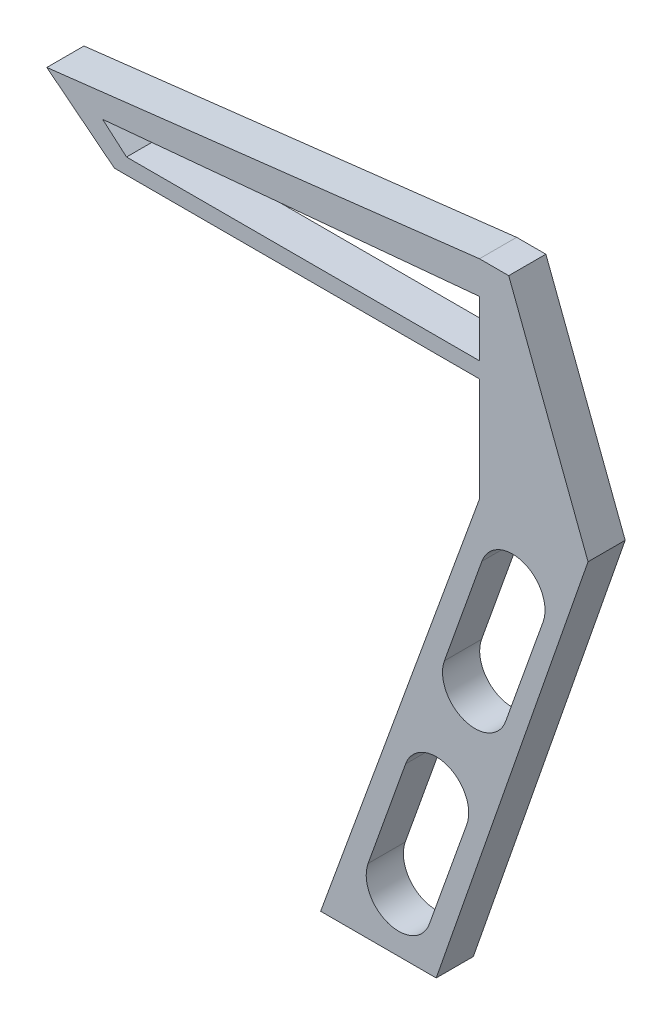
ISO-10303-21;
HEADER;
FILE_DESCRIPTION(('STEP AP214'),'2;1');
FILE_NAME('part.step','',(''),(''),'','','');
FILE_SCHEMA(('AUTOMOTIVE_DESIGN { 1 0 10303 214 1 1 1 1 }'));
ENDSEC;
DATA;
#1=APPLICATION_CONTEXT('core data for automotive mechanical design processes');
#2=APPLICATION_PROTOCOL_DEFINITION('international standard','automotive_design',2000,#1);
#3=PRODUCT_CONTEXT('',#1,'mechanical');
#4=PRODUCT('Part','Part','',(#3));
#5=PRODUCT_RELATED_PRODUCT_CATEGORY('part','',(#4));
#6=PRODUCT_DEFINITION_FORMATION('','',#4);
#7=PRODUCT_DEFINITION_CONTEXT('part definition',#1,'design');
#8=PRODUCT_DEFINITION('design','',#6,#7);
#9=PRODUCT_DEFINITION_SHAPE('','',#8);
#10=(LENGTH_UNIT() NAMED_UNIT(*) SI_UNIT(.MILLI.,.METRE.));
#11=(NAMED_UNIT(*) PLANE_ANGLE_UNIT() SI_UNIT($,.RADIAN.));
#12=(NAMED_UNIT(*) SI_UNIT($,.STERADIAN.) SOLID_ANGLE_UNIT());
#13=UNCERTAINTY_MEASURE_WITH_UNIT(LENGTH_MEASURE(1.E-05),#10,'distance_accuracy_value','');
#14=(GEOMETRIC_REPRESENTATION_CONTEXT(3) GLOBAL_UNCERTAINTY_ASSIGNED_CONTEXT((#13)) GLOBAL_UNIT_ASSIGNED_CONTEXT((#10,
#11,#12)) REPRESENTATION_CONTEXT('',''));
#15=CARTESIAN_POINT('',(0.,0.,0.));
#16=DIRECTION('',(0.,0.,1.));
#17=DIRECTION('',(1.,0.,0.));
#18=AXIS2_PLACEMENT_3D('',#15,#16,#17);
#19=CARTESIAN_POINT('',(0.,0.,20.));
#20=DIRECTION('',(-1.,0.,0.));
#21=DIRECTION('',(0.,0.,1.));
#22=AXIS2_PLACEMENT_3D('',#19,#20,#21);
#23=PLANE('',#22);
#24=DIRECTION('',(0.,1.,0.));
#25=VECTOR('',#24,1.);
#26=CARTESIAN_POINT('',(0.,0.,0.));
#27=LINE('',#26,#25);
#28=CARTESIAN_POINT('',(0.,0.,0.));
#29=VERTEX_POINT('',#28);
#30=CARTESIAN_POINT('',(0.,30.,0.));
#31=VERTEX_POINT('',#30);
#32=EDGE_CURVE('E256',#29,#31,#27,.T.);
#33=ORIENTED_EDGE('',*,*,#32,.F.);
#34=DIRECTION('',(0.,0.,-1.));
#35=VECTOR('',#34,1.);
#36=CARTESIAN_POINT('',(0.,0.,20.));
#37=LINE('',#36,#35);
#38=CARTESIAN_POINT('',(0.,0.,20.));
#39=VERTEX_POINT('',#38);
#40=EDGE_CURVE('E11',#39,#29,#37,.T.);
#41=ORIENTED_EDGE('',*,*,#40,.F.);
#42=DIRECTION('',(0.,1.,0.));
#43=VECTOR('',#42,1.);
#44=CARTESIAN_POINT('',(0.,0.,20.));
#45=LINE('',#44,#43);
#46=CARTESIAN_POINT('',(0.,30.,20.));
#47=VERTEX_POINT('',#46);
#48=EDGE_CURVE('E202',#39,#47,#45,.T.);
#49=ORIENTED_EDGE('',*,*,#48,.T.);
#50=DIRECTION('',(0.,0.,-1.));
#51=VECTOR('',#50,1.);
#52=CARTESIAN_POINT('',(0.,30.,20.));
#53=LINE('',#52,#51);
#54=EDGE_CURVE('E55',#47,#31,#53,.T.);
#55=ORIENTED_EDGE('',*,*,#54,.T.);
#56=EDGE_LOOP('',(#33,#41,#49,#55));
#57=FACE_BOUND('',#56,.T.);
#58=ADVANCED_FACE('F36',(#57),#23,.T.);
#59=CARTESIAN_POINT('',(0.,0.,20.));
#60=DIRECTION('',(0.,1.,0.));
#61=DIRECTION('',(0.,0.,1.));
#62=AXIS2_PLACEMENT_3D('',#59,#60,#61);
#63=PLANE('',#62);
#64=DIRECTION('',(1.,0.,0.));
#65=VECTOR('',#64,1.);
#66=CARTESIAN_POINT('',(0.,0.,0.));
#67=LINE('',#66,#65);
#68=CARTESIAN_POINT('',(-190.,0.,0.));
#69=VERTEX_POINT('',#68);
#70=EDGE_CURVE('E191',#69,#29,#67,.T.);
#71=ORIENTED_EDGE('',*,*,#70,.F.);
#72=DIRECTION('',(0.,0.,-1.));
#73=VECTOR('',#72,1.);
#74=CARTESIAN_POINT('',(-190.,0.,20.));
#75=LINE('',#74,#73);
#76=CARTESIAN_POINT('',(-190.,0.,20.));
#77=VERTEX_POINT('',#76);
#78=EDGE_CURVE('E46',#77,#69,#75,.T.);
#79=ORIENTED_EDGE('',*,*,#78,.F.);
#80=DIRECTION('',(1.,0.,0.));
#81=VECTOR('',#80,1.);
#82=CARTESIAN_POINT('',(0.,0.,20.));
#83=LINE('',#82,#81);
#84=EDGE_CURVE('E189',#77,#39,#83,.T.);
#85=ORIENTED_EDGE('',*,*,#84,.T.);
#86=ORIENTED_EDGE('',*,*,#40,.T.);
#87=EDGE_LOOP('',(#71,#79,#85,#86));
#88=FACE_BOUND('',#87,.T.);
#89=ADVANCED_FACE('F188',(#88),#63,.T.);
#90=CARTESIAN_POINT('',(-81.4268809778505,-94.0253712569675,20.));
#91=DIRECTION('',(0.654646875393422,0.755934830880036,0.));
#92=DIRECTION('',(-0.755934830880036,0.654646875393422,0.));
#93=AXIS2_PLACEMENT_3D('',#90,#91,#92);
#94=PLANE('',#93);
#95=DIRECTION('',(0.755934830880036,-0.654646875393422,0.));
#96=VECTOR('',#95,1.);
#97=CARTESIAN_POINT('',(-81.4268809778505,-94.0253712569675,0.));
#98=LINE('',#97,#96);
#99=CARTESIAN_POINT('',(-202.860967669863,11.1377224010301,0.));
#100=VERTEX_POINT('',#99);
#101=EDGE_CURVE('E259',#100,#69,#98,.T.);
#102=ORIENTED_EDGE('',*,*,#101,.F.);
#103=DIRECTION('',(0.,0.,-1.));
#104=VECTOR('',#103,1.);
#105=CARTESIAN_POINT('',(-202.860967669863,11.1377224010301,20.));
#106=LINE('',#105,#104);
#107=CARTESIAN_POINT('',(-202.860967669863,11.1377224010301,20.));
#108=VERTEX_POINT('',#107);
#109=EDGE_CURVE('E119',#108,#100,#106,.T.);
#110=ORIENTED_EDGE('',*,*,#109,.F.);
#111=DIRECTION('',(0.755934830880036,-0.654646875393422,0.));
#112=VECTOR('',#111,1.);
#113=CARTESIAN_POINT('',(-81.4268809778505,-94.0253712569675,20.));
#114=LINE('',#113,#112);
#115=EDGE_CURVE('E201',#108,#77,#114,.T.);
#116=ORIENTED_EDGE('',*,*,#115,.T.);
#117=ORIENTED_EDGE('',*,*,#78,.T.);
#118=EDGE_LOOP('',(#102,#110,#116,#117));
#119=FACE_BOUND('',#118,.T.);
#120=ADVANCED_FACE('F204',(#119),#94,.T.);
#121=CARTESIAN_POINT('',(-2.39478141390136,-155.187164151721,20.));
#122=DIRECTION('',(0.,0.,-1.));
#123=DIRECTION('',(-1.,0.,0.));
#124=AXIS2_PLACEMENT_3D('',#121,#122,#123);
#125=CYLINDRICAL_SURFACE('',#124,17.5);
#126=CARTESIAN_POINT('',(-2.39478141390136,-155.187164151721,0.));
#127=DIRECTION('',(0.,0.,1.));
#128=DIRECTION('',(1.,0.,0.));
#129=AXIS2_PLACEMENT_3D('',#126,#127,#128);
#130=CIRCLE('',#129,17.5);
#131=CARTESIAN_POINT('',(-18.8752790768257,-149.301316992446,0.));
#132=VERTEX_POINT('',#131);
#133=CARTESIAN_POINT('',(14.0857162490229,-161.073011310997,0.));
#134=VERTEX_POINT('',#133);
#135=EDGE_CURVE('E244',#132,#134,#130,.T.);
#136=ORIENTED_EDGE('',*,*,#135,.F.);
#137=DIRECTION('',(0.,0.,-1.));
#138=VECTOR('',#137,1.);
#139=CARTESIAN_POINT('',(-18.8752790768257,-149.301316992446,20.));
#140=LINE('',#139,#138);
#141=CARTESIAN_POINT('',(-18.8752790768257,-149.301316992446,20.));
#142=VERTEX_POINT('',#141);
#143=EDGE_CURVE('E266',#142,#132,#140,.T.);
#144=ORIENTED_EDGE('',*,*,#143,.F.);
#145=CARTESIAN_POINT('',(-2.39478141390136,-155.187164151721,20.));
#146=DIRECTION('',(0.,0.,1.));
#147=DIRECTION('',(1.,0.,0.));
#148=AXIS2_PLACEMENT_3D('',#145,#146,#147);
#149=CIRCLE('',#148,17.5);
#150=CARTESIAN_POINT('',(14.0857162490229,-161.073011310997,20.));
#151=VERTEX_POINT('',#150);
#152=EDGE_CURVE('E354',#142,#151,#149,.T.);
#153=ORIENTED_EDGE('',*,*,#152,.T.);
#154=DIRECTION('',(0.,0.,-1.));
#155=VECTOR('',#154,1.);
#156=CARTESIAN_POINT('',(14.0857162490229,-161.073011310997,20.));
#157=LINE('',#156,#155);
#158=EDGE_CURVE('E268',#151,#134,#157,.T.);
#159=ORIENTED_EDGE('',*,*,#158,.T.);
#160=EDGE_LOOP('',(#136,#144,#153,#159));
#161=FACE_BOUND('',#160,.T.);
#162=ADVANCED_FACE('F398',(#161),#125,.F.);
#163=CARTESIAN_POINT('',(30.5496356253496,-10.9105009897164,20.));
#164=DIRECTION('',(0.941742723595674,-0.336334123387149,0.));
#165=DIRECTION('',(0.336334123387149,0.941742723595674,0.));
#166=AXIS2_PLACEMENT_3D('',#163,#164,#165);
#167=PLANE('',#166);
#168=DIRECTION('',(-0.336334123387149,-0.941742723595674,0.));
#169=VECTOR('',#168,1.);
#170=CARTESIAN_POINT('',(30.5496356253496,-10.9105009897164,0.));
#171=LINE('',#170,#169);
#172=CARTESIAN_POINT('',(1.30476832640328,-92.796753576706,0.));
#173=VERTEX_POINT('',#172);
#174=EDGE_CURVE('E247',#173,#132,#171,.T.);
#175=ORIENTED_EDGE('',*,*,#174,.F.);
#176=DIRECTION('',(0.,0.,-1.));
#177=VECTOR('',#176,1.);
#178=CARTESIAN_POINT('',(1.30476832640328,-92.796753576706,20.));
#179=LINE('',#178,#177);
#180=CARTESIAN_POINT('',(1.30476832640328,-92.796753576706,20.));
#181=VERTEX_POINT('',#180);
#182=EDGE_CURVE('E273',#181,#173,#179,.T.);
#183=ORIENTED_EDGE('',*,*,#182,.F.);
#184=DIRECTION('',(-0.336334123387149,-0.941742723595674,0.));
#185=VECTOR('',#184,1.);
#186=CARTESIAN_POINT('',(30.5496356253496,-10.9105009897164,20.));
#187=LINE('',#186,#185);
#188=EDGE_CURVE('E357',#181,#142,#187,.T.);
#189=ORIENTED_EDGE('',*,*,#188,.T.);
#190=ORIENTED_EDGE('',*,*,#143,.T.);
#191=EDGE_LOOP('',(#175,#183,#189,#190));
#192=FACE_BOUND('',#191,.T.);
#193=ADVANCED_FACE('F394',(#192),#167,.T.);
#194=CARTESIAN_POINT('',(17.7852659893276,-98.6826007359811,20.));
#195=DIRECTION('',(0.,0.,-1.));
#196=DIRECTION('',(-1.,0.,0.));
#197=AXIS2_PLACEMENT_3D('',#194,#195,#196);
#198=CYLINDRICAL_SURFACE('',#197,17.5);
#199=CARTESIAN_POINT('',(17.7852659893276,-98.6826007359811,0.));
#200=DIRECTION('',(0.,0.,1.));
#201=DIRECTION('',(1.,0.,0.));
#202=AXIS2_PLACEMENT_3D('',#199,#200,#201);
#203=CIRCLE('',#202,17.5);
#204=CARTESIAN_POINT('',(34.2657636522519,-104.568447895256,0.));
#205=VERTEX_POINT('',#204);
#206=EDGE_CURVE('E250',#205,#173,#203,.T.);
#207=ORIENTED_EDGE('',*,*,#206,.F.);
#208=DIRECTION('',(0.,0.,-1.));
#209=VECTOR('',#208,1.);
#210=CARTESIAN_POINT('',(34.2657636522519,-104.568447895256,20.));
#211=LINE('',#210,#209);
#212=CARTESIAN_POINT('',(34.2657636522519,-104.568447895256,20.));
#213=VERTEX_POINT('',#212);
#214=EDGE_CURVE('E270',#213,#205,#211,.T.);
#215=ORIENTED_EDGE('',*,*,#214,.F.);
#216=CARTESIAN_POINT('',(17.7852659893276,-98.6826007359811,20.));
#217=DIRECTION('',(0.,0.,1.));
#218=DIRECTION('',(1.,0.,0.));
#219=AXIS2_PLACEMENT_3D('',#216,#217,#218);
#220=CIRCLE('',#219,17.5);
#221=EDGE_CURVE('E360',#213,#181,#220,.T.);
#222=ORIENTED_EDGE('',*,*,#221,.T.);
#223=ORIENTED_EDGE('',*,*,#182,.T.);
#224=EDGE_LOOP('',(#207,#215,#222,#223));
#225=FACE_BOUND('',#224,.T.);
#226=ADVANCED_FACE('F390',(#225),#198,.F.);
#227=CARTESIAN_POINT('',(-43.4763949847619,-270.216558922331,20.));
#228=DIRECTION('',(0.,0.,-1.));
#229=DIRECTION('',(-1.,0.,0.));
#230=AXIS2_PLACEMENT_3D('',#227,#228,#229);
#231=CYLINDRICAL_SURFACE('',#230,17.5);
#232=CARTESIAN_POINT('',(-43.4763949847619,-270.216558922331,0.));
#233=DIRECTION('',(0.,0.,1.));
#234=DIRECTION('',(1.,0.,0.));
#235=AXIS2_PLACEMENT_3D('',#232,#233,#234);
#236=CIRCLE('',#235,17.5);
#237=CARTESIAN_POINT('',(-59.9568926476862,-264.330711763056,0.));
#238=VERTEX_POINT('',#237);
#239=CARTESIAN_POINT('',(-26.9958973218376,-276.102406081606,0.));
#240=VERTEX_POINT('',#239);
#241=EDGE_CURVE('E232',#238,#240,#236,.T.);
#242=ORIENTED_EDGE('',*,*,#241,.F.);
#243=DIRECTION('',(0.,0.,-1.));
#244=VECTOR('',#243,1.);
#245=CARTESIAN_POINT('',(-59.9568926476862,-264.330711763056,20.));
#246=LINE('',#245,#244);
#247=CARTESIAN_POINT('',(-59.9568926476862,-264.330711763056,20.));
#248=VERTEX_POINT('',#247);
#249=EDGE_CURVE('E271',#248,#238,#246,.T.);
#250=ORIENTED_EDGE('',*,*,#249,.F.);
#251=CARTESIAN_POINT('',(-43.4763949847619,-270.216558922331,20.));
#252=DIRECTION('',(0.,0.,1.));
#253=DIRECTION('',(1.,0.,0.));
#254=AXIS2_PLACEMENT_3D('',#251,#252,#253);
#255=CIRCLE('',#254,17.5);
#256=CARTESIAN_POINT('',(-26.9958973218376,-276.102406081606,20.));
#257=VERTEX_POINT('',#256);
#258=EDGE_CURVE('E343',#248,#257,#255,.T.);
#259=ORIENTED_EDGE('',*,*,#258,.T.);
#260=DIRECTION('',(0.,0.,-1.));
#261=VECTOR('',#260,1.);
#262=CARTESIAN_POINT('',(-26.9958973218376,-276.102406081606,20.));
#263=LINE('',#262,#261);
#264=EDGE_CURVE('E276',#257,#240,#263,.T.);
#265=ORIENTED_EDGE('',*,*,#264,.T.);
#266=EDGE_LOOP('',(#242,#250,#259,#265));
#267=FACE_BOUND('',#266,.T.);
#268=ADVANCED_FACE('F393',(#267),#231,.F.);
#269=CARTESIAN_POINT('',(30.5496356253497,-10.9105009897164,20.));
#270=DIRECTION('',(0.941742723595674,-0.336334123387149,0.));
#271=DIRECTION('',(0.336334123387149,0.941742723595674,0.));
#272=AXIS2_PLACEMENT_3D('',#269,#270,#271);
#273=PLANE('',#272);
#274=DIRECTION('',(-0.336334123387149,-0.941742723595674,0.));
#275=VECTOR('',#274,1.);
#276=CARTESIAN_POINT('',(30.5496356253497,-10.9105009897164,0.));
#277=LINE('',#276,#275);
#278=CARTESIAN_POINT('',(-39.7768452444572,-207.826148347315,0.));
#279=VERTEX_POINT('',#278);
#280=EDGE_CURVE('E235',#279,#238,#277,.T.);
#281=ORIENTED_EDGE('',*,*,#280,.F.);
#282=DIRECTION('',(0.,0.,-1.));
#283=VECTOR('',#282,1.);
#284=CARTESIAN_POINT('',(-39.7768452444572,-207.826148347315,20.));
#285=LINE('',#284,#283);
#286=CARTESIAN_POINT('',(-39.7768452444572,-207.826148347315,20.));
#287=VERTEX_POINT('',#286);
#288=EDGE_CURVE('E280',#287,#279,#285,.T.);
#289=ORIENTED_EDGE('',*,*,#288,.F.);
#290=DIRECTION('',(-0.336334123387149,-0.941742723595674,0.));
#291=VECTOR('',#290,1.);
#292=CARTESIAN_POINT('',(30.5496356253497,-10.9105009897164,20.));
#293=LINE('',#292,#291);
#294=EDGE_CURVE('E346',#287,#248,#293,.T.);
#295=ORIENTED_EDGE('',*,*,#294,.T.);
#296=ORIENTED_EDGE('',*,*,#249,.T.);
#297=EDGE_LOOP('',(#281,#289,#295,#296));
#298=FACE_BOUND('',#297,.T.);
#299=ADVANCED_FACE('F409',(#298),#273,.T.);
#300=CARTESIAN_POINT('',(-23.2963475815329,-213.71199550659,20.));
#301=DIRECTION('',(0.,0.,-1.));
#302=DIRECTION('',(-1.,0.,0.));
#303=AXIS2_PLACEMENT_3D('',#300,#301,#302);
#304=CYLINDRICAL_SURFACE('',#303,17.5);
#305=CARTESIAN_POINT('',(-23.2963475815329,-213.71199550659,0.));
#306=DIRECTION('',(0.,0.,1.));
#307=DIRECTION('',(1.,0.,0.));
#308=AXIS2_PLACEMENT_3D('',#305,#306,#307);
#309=CIRCLE('',#308,17.5);
#310=CARTESIAN_POINT('',(-6.81584991860862,-219.597842665865,0.));
#311=VERTEX_POINT('',#310);
#312=EDGE_CURVE('E238',#311,#279,#309,.T.);
#313=ORIENTED_EDGE('',*,*,#312,.F.);
#314=DIRECTION('',(0.,0.,-1.));
#315=VECTOR('',#314,1.);
#316=CARTESIAN_POINT('',(-6.81584991860862,-219.597842665865,20.));
#317=LINE('',#316,#315);
#318=CARTESIAN_POINT('',(-6.81584991860862,-219.597842665865,20.));
#319=VERTEX_POINT('',#318);
#320=EDGE_CURVE('E278',#319,#311,#317,.T.);
#321=ORIENTED_EDGE('',*,*,#320,.F.);
#322=CARTESIAN_POINT('',(-23.2963475815329,-213.71199550659,20.));
#323=DIRECTION('',(0.,0.,1.));
#324=DIRECTION('',(1.,0.,0.));
#325=AXIS2_PLACEMENT_3D('',#322,#323,#324);
#326=CIRCLE('',#325,17.5);
#327=EDGE_CURVE('E349',#319,#287,#326,.T.);
#328=ORIENTED_EDGE('',*,*,#327,.T.);
#329=ORIENTED_EDGE('',*,*,#288,.T.);
#330=EDGE_LOOP('',(#313,#321,#328,#329));
#331=FACE_BOUND('',#330,.T.);
#332=ADVANCED_FACE('F406',(#331),#304,.F.);
#333=CARTESIAN_POINT('',(0.,-8.45740838362147,20.));
#334=DIRECTION('',(0.,1.,0.));
#335=DIRECTION('',(0.,0.,1.));
#336=AXIS2_PLACEMENT_3D('',#333,#334,#335);
#337=PLANE('',#336);
#338=DIRECTION('',(1.,0.,0.));
#339=VECTOR('',#338,1.);
#340=CARTESIAN_POINT('',(0.,-8.45740838362147,0.));
#341=LINE('',#340,#339);
#342=CARTESIAN_POINT('',(-196.533735711257,-8.45740838362144,0.));
#343=VERTEX_POINT('',#342);
#344=CARTESIAN_POINT('',(0.,-8.45740838362147,0.));
#345=VERTEX_POINT('',#344);
#346=EDGE_CURVE('E211',#343,#345,#341,.T.);
#347=ORIENTED_EDGE('',*,*,#346,.T.);
#348=DIRECTION('',(0.,0.,-1.));
#349=VECTOR('',#348,1.);
#350=CARTESIAN_POINT('',(0.,-8.45740838362147,20.));
#351=LINE('',#350,#349);
#352=CARTESIAN_POINT('',(0.,-8.45740838362147,20.));
#353=VERTEX_POINT('',#352);
#354=EDGE_CURVE('E40',#353,#345,#351,.T.);
#355=ORIENTED_EDGE('',*,*,#354,.F.);
#356=DIRECTION('',(1.,0.,0.));
#357=VECTOR('',#356,1.);
#358=CARTESIAN_POINT('',(0.,-8.45740838362147,20.));
#359=LINE('',#358,#357);
#360=CARTESIAN_POINT('',(-196.533735711257,-8.45740838362144,20.));
#361=VERTEX_POINT('',#360);
#362=EDGE_CURVE('E264',#361,#353,#359,.T.);
#363=ORIENTED_EDGE('',*,*,#362,.F.);
#364=DIRECTION('',(0.,0.,-1.));
#365=VECTOR('',#364,1.);
#366=CARTESIAN_POINT('',(-196.533735711257,-8.45740838362144,20.));
#367=LINE('',#366,#365);
#368=EDGE_CURVE('E207',#361,#343,#367,.T.);
#369=ORIENTED_EDGE('',*,*,#368,.T.);
#370=EDGE_LOOP('',(#347,#355,#363,#369));
#371=FACE_BOUND('',#370,.T.);
#372=ADVANCED_FACE('F38',(#371),#337,.F.);
#373=CARTESIAN_POINT('',(0.,0.,20.));
#374=DIRECTION('',(1.,0.,0.));
#375=DIRECTION('',(0.,0.,-1.));
#376=AXIS2_PLACEMENT_3D('',#373,#374,#375);
#377=PLANE('',#376);
#378=DIRECTION('',(0.,-1.,0.));
#379=VECTOR('',#378,1.);
#380=CARTESIAN_POINT('',(0.,0.,0.));
#381=LINE('',#380,#379);
#382=CARTESIAN_POINT('',(0.,-64.4777495769881,0.));
#383=VERTEX_POINT('',#382);
#384=EDGE_CURVE('E214',#345,#383,#381,.T.);
#385=ORIENTED_EDGE('',*,*,#384,.T.);
#386=DIRECTION('',(0.,0.,-1.));
#387=VECTOR('',#386,1.);
#388=CARTESIAN_POINT('',(0.,-64.4777495769881,20.));
#389=LINE('',#388,#387);
#390=CARTESIAN_POINT('',(0.,-64.4777495769881,20.));
#391=VERTEX_POINT('',#390);
#392=EDGE_CURVE('E300',#391,#383,#389,.T.);
#393=ORIENTED_EDGE('',*,*,#392,.F.);
#394=DIRECTION('',(0.,-1.,0.));
#395=VECTOR('',#394,1.);
#396=CARTESIAN_POINT('',(0.,0.,20.));
#397=LINE('',#396,#395);
#398=EDGE_CURVE('E132',#353,#391,#397,.T.);
#399=ORIENTED_EDGE('',*,*,#398,.F.);
#400=ORIENTED_EDGE('',*,*,#354,.T.);
#401=EDGE_LOOP('',(#385,#393,#399,#400));
#402=FACE_BOUND('',#401,.T.);
#403=ADVANCED_FACE('F306',(#402),#377,.F.);
#404=CARTESIAN_POINT('',(20.7227492642798,-7.54246390435971,20.));
#405=DIRECTION('',(0.939692620785908,-0.34202014332567,0.));
#406=DIRECTION('',(0.34202014332567,0.939692620785908,0.));
#407=AXIS2_PLACEMENT_3D('',#404,#405,#406);
#408=PLANE('',#407);
#409=DIRECTION('',(-0.34202014332567,-0.939692620785908,0.));
#410=VECTOR('',#409,1.);
#411=CARTESIAN_POINT('',(20.7227492642798,-7.54246390435971,0.));
#412=LINE('',#411,#410);
#413=CARTESIAN_POINT('',(-85.5050358314174,-299.400904773465,0.));
#414=VERTEX_POINT('',#413);
#415=EDGE_CURVE('E216',#383,#414,#412,.T.);
#416=ORIENTED_EDGE('',*,*,#415,.T.);
#417=DIRECTION('',(0.,0.,-1.));
#418=VECTOR('',#417,1.);
#419=CARTESIAN_POINT('',(-85.5050358314174,-299.400904773465,20.));
#420=LINE('',#419,#418);
#421=CARTESIAN_POINT('',(-85.5050358314174,-299.400904773465,20.));
#422=VERTEX_POINT('',#421);
#423=EDGE_CURVE('E298',#422,#414,#420,.T.);
#424=ORIENTED_EDGE('',*,*,#423,.F.);
#425=DIRECTION('',(-0.34202014332567,-0.939692620785908,0.));
#426=VECTOR('',#425,1.);
#427=CARTESIAN_POINT('',(20.7227492642798,-7.54246390435971,20.));
#428=LINE('',#427,#426);
#429=EDGE_CURVE('E328',#391,#422,#428,.T.);
#430=ORIENTED_EDGE('',*,*,#429,.F.);
#431=ORIENTED_EDGE('',*,*,#392,.T.);
#432=EDGE_LOOP('',(#416,#424,#430,#431));
#433=FACE_BOUND('',#432,.T.);
#434=ADVANCED_FACE('F319',(#433),#408,.F.);
#435=CARTESIAN_POINT('',(0.,-299.400904773465,20.));
#436=DIRECTION('',(0.,1.,0.));
#437=DIRECTION('',(0.,0.,1.));
#438=AXIS2_PLACEMENT_3D('',#435,#436,#437);
#439=PLANE('',#438);
#440=DIRECTION('',(1.,0.,0.));
#441=VECTOR('',#440,1.);
#442=CARTESIAN_POINT('',(0.,-299.400904773465,0.));
#443=LINE('',#442,#441);
#444=CARTESIAN_POINT('',(-23.2963475815329,-299.400904773465,0.));
#445=VERTEX_POINT('',#444);
#446=EDGE_CURVE('E218',#414,#445,#443,.T.);
#447=ORIENTED_EDGE('',*,*,#446,.T.);
#448=DIRECTION('',(0.,0.,-1.));
#449=VECTOR('',#448,1.);
#450=CARTESIAN_POINT('',(-23.2963475815329,-299.400904773465,20.));
#451=LINE('',#450,#449);
#452=CARTESIAN_POINT('',(-23.2963475815329,-299.400904773465,20.));
#453=VERTEX_POINT('',#452);
#454=EDGE_CURVE('E295',#453,#445,#451,.T.);
#455=ORIENTED_EDGE('',*,*,#454,.F.);
#456=DIRECTION('',(1.,0.,0.));
#457=VECTOR('',#456,1.);
#458=CARTESIAN_POINT('',(0.,-299.400904773465,20.));
#459=LINE('',#458,#457);
#460=EDGE_CURVE('E324',#422,#453,#459,.T.);
#461=ORIENTED_EDGE('',*,*,#460,.F.);
#462=ORIENTED_EDGE('',*,*,#423,.T.);
#463=EDGE_LOOP('',(#447,#455,#461,#462));
#464=FACE_BOUND('',#463,.T.);
#465=ADVANCED_FACE('F322',(#464),#439,.F.);
#466=CARTESIAN_POINT('',(72.1432024489597,-25.1014529312597,20.));
#467=DIRECTION('',(-0.944463624168088,0.328615980474596,0.));
#468=DIRECTION('',(-0.328615980474596,-0.944463624168088,0.));
#469=AXIS2_PLACEMENT_3D('',#466,#467,#468);
#470=PLANE('',#469);
#471=DIRECTION('',(0.328615980474596,0.944463624168088,0.));
#472=VECTOR('',#471,1.);
#473=CARTESIAN_POINT('',(72.1432024489597,-25.1014529312597,0.));
#474=LINE('',#473,#472);
#475=CARTESIAN_POINT('',(58.4426426829949,-64.4777495769881,0.));
#476=VERTEX_POINT('',#475);
#477=EDGE_CURVE('E220',#445,#476,#474,.T.);
#478=ORIENTED_EDGE('',*,*,#477,.T.);
#479=DIRECTION('',(0.,0.,-1.));
#480=VECTOR('',#479,1.);
#481=CARTESIAN_POINT('',(58.4426426829949,-64.4777495769881,20.));
#482=LINE('',#481,#480);
#483=CARTESIAN_POINT('',(58.4426426829949,-64.4777495769881,20.));
#484=VERTEX_POINT('',#483);
#485=EDGE_CURVE('E292',#484,#476,#482,.T.);
#486=ORIENTED_EDGE('',*,*,#485,.F.);
#487=DIRECTION('',(0.328615980474596,0.944463624168088,0.));
#488=VECTOR('',#487,1.);
#489=CARTESIAN_POINT('',(72.1432024489597,-25.1014529312597,20.));
#490=LINE('',#489,#488);
#491=EDGE_CURVE('E327',#453,#484,#490,.T.);
#492=ORIENTED_EDGE('',*,*,#491,.F.);
#493=ORIENTED_EDGE('',*,*,#454,.T.);
#494=EDGE_LOOP('',(#478,#486,#492,#493));
#495=FACE_BOUND('',#494,.T.);
#496=ADVANCED_FACE('F427',(#495),#470,.F.);
#497=CARTESIAN_POINT('',(29.5738046548645,11.2709680529257,20.));
#498=DIRECTION('',(-0.934437725490428,-0.356126574661702,0.));
#499=DIRECTION('',(0.356126574661702,-0.934437725490428,0.));
#500=AXIS2_PLACEMENT_3D('',#497,#498,#499);
#501=PLANE('',#500);
#502=DIRECTION('',(-0.356126574661702,0.934437725490427,0.));
#503=VECTOR('',#502,1.);
#504=CARTESIAN_POINT('',(29.5738046548645,11.2709680529257,0.));
#505=LINE('',#504,#503);
#506=CARTESIAN_POINT('',(15.7424569427352,47.5629328097452,0.));
#507=VERTEX_POINT('',#506);
#508=EDGE_CURVE('E222',#476,#507,#505,.T.);
#509=ORIENTED_EDGE('',*,*,#508,.T.);
#510=DIRECTION('',(0.,0.,-1.));
#511=VECTOR('',#510,1.);
#512=CARTESIAN_POINT('',(15.7424569427352,47.5629328097452,20.));
#513=LINE('',#512,#511);
#514=CARTESIAN_POINT('',(15.7424569427352,47.5629328097452,20.));
#515=VERTEX_POINT('',#514);
#516=EDGE_CURVE('E290',#515,#507,#513,.T.);
#517=ORIENTED_EDGE('',*,*,#516,.F.);
#518=DIRECTION('',(-0.356126574661702,0.934437725490427,0.));
#519=VECTOR('',#518,1.);
#520=CARTESIAN_POINT('',(29.5738046548645,11.2709680529257,20.));
#521=LINE('',#520,#519);
#522=EDGE_CURVE('E330',#484,#515,#521,.T.);
#523=ORIENTED_EDGE('',*,*,#522,.F.);
#524=ORIENTED_EDGE('',*,*,#485,.T.);
#525=EDGE_LOOP('',(#509,#517,#523,#524));
#526=FACE_BOUND('',#525,.T.);
#527=ADVANCED_FACE('F423',(#526),#501,.F.);
#528=CARTESIAN_POINT('',(0.,47.5629328097452,20.));
#529=DIRECTION('',(0.,1.,0.));
#530=DIRECTION('',(0.,0.,1.));
#531=AXIS2_PLACEMENT_3D('',#528,#529,#530);
#532=PLANE('',#531);
#533=DIRECTION('',(1.,0.,0.));
#534=VECTOR('',#533,1.);
#535=CARTESIAN_POINT('',(0.,47.5629328097452,0.));
#536=LINE('',#535,#534);
#537=CARTESIAN_POINT('',(0.,47.5629328097452,0.));
#538=VERTEX_POINT('',#537);
#539=EDGE_CURVE('E225',#538,#507,#536,.T.);
#540=ORIENTED_EDGE('',*,*,#539,.F.);
#541=DIRECTION('',(0.,0.,-1.));
#542=VECTOR('',#541,1.);
#543=CARTESIAN_POINT('',(0.,47.5629328097452,20.));
#544=LINE('',#543,#542);
#545=CARTESIAN_POINT('',(0.,47.5629328097452,20.));
#546=VERTEX_POINT('',#545);
#547=EDGE_CURVE('E288',#546,#538,#544,.T.);
#548=ORIENTED_EDGE('',*,*,#547,.F.);
#549=DIRECTION('',(1.,0.,0.));
#550=VECTOR('',#549,1.);
#551=CARTESIAN_POINT('',(0.,47.5629328097452,20.));
#552=LINE('',#551,#550);
#553=EDGE_CURVE('E336',#546,#515,#552,.T.);
#554=ORIENTED_EDGE('',*,*,#553,.T.);
#555=ORIENTED_EDGE('',*,*,#516,.T.);
#556=EDGE_LOOP('',(#540,#548,#554,#555));
#557=FACE_BOUND('',#556,.T.);
#558=ADVANCED_FACE('F419',(#557),#532,.T.);
#559=CARTESIAN_POINT('',(-5.49311415856855,46.919829380827,20.));
#560=DIRECTION('',(0.116280288211657,-0.993216438936355,0.));
#561=DIRECTION('',(0.993216438936355,0.116280288211657,0.));
#562=AXIS2_PLACEMENT_3D('',#559,#560,#561);
#563=PLANE('',#562);
#564=DIRECTION('',(-0.993216438936355,-0.116280288211657,0.));
#565=VECTOR('',#564,1.);
#566=CARTESIAN_POINT('',(-5.49311415856855,46.919829380827,0.));
#567=LINE('',#566,#565);
#568=CARTESIAN_POINT('',(-232.911164776465,20.2949816299163,0.));
#569=VERTEX_POINT('',#568);
#570=EDGE_CURVE('E228',#538,#569,#567,.T.);
#571=ORIENTED_EDGE('',*,*,#570,.T.);
#572=DIRECTION('',(0.,0.,-1.));
#573=VECTOR('',#572,1.);
#574=CARTESIAN_POINT('',(-232.911164776465,20.2949816299163,20.));
#575=LINE('',#574,#573);
#576=CARTESIAN_POINT('',(-232.911164776465,20.2949816299163,20.));
#577=VERTEX_POINT('',#576);
#578=EDGE_CURVE('E285',#577,#569,#575,.T.);
#579=ORIENTED_EDGE('',*,*,#578,.F.);
#580=DIRECTION('',(-0.993216438936355,-0.116280288211657,0.));
#581=VECTOR('',#580,1.);
#582=CARTESIAN_POINT('',(-5.49311415856855,46.919829380827,20.));
#583=LINE('',#582,#581);
#584=EDGE_CURVE('E339',#546,#577,#583,.T.);
#585=ORIENTED_EDGE('',*,*,#584,.F.);
#586=ORIENTED_EDGE('',*,*,#547,.T.);
#587=EDGE_LOOP('',(#571,#579,#585,#586));
#588=FACE_BOUND('',#587,.T.);
#589=ADVANCED_FACE('F388',(#588),#563,.F.);
#590=CARTESIAN_POINT('',(63.5106309511983,-22.6821953082667,20.));
#591=DIRECTION('',(0.941742723595674,-0.33633412338715,0.));
#592=DIRECTION('',(0.33633412338715,0.941742723595674,0.));
#593=AXIS2_PLACEMENT_3D('',#590,#591,#592);
#594=PLANE('',#593);
#595=DIRECTION('',(-0.33633412338715,-0.941742723595674,0.));
#596=VECTOR('',#595,1.);
#597=CARTESIAN_POINT('',(63.5106309511983,-22.6821953082667,0.));
#598=LINE('',#597,#596);
#599=EDGE_CURVE('E253',#205,#134,#598,.T.);
#600=ORIENTED_EDGE('',*,*,#599,.T.);
#601=ORIENTED_EDGE('',*,*,#158,.F.);
#602=DIRECTION('',(-0.33633412338715,-0.941742723595674,0.));
#603=VECTOR('',#602,1.);
#604=CARTESIAN_POINT('',(63.5106309511983,-22.6821953082667,20.));
#605=LINE('',#604,#603);
#606=EDGE_CURVE('E363',#213,#151,#605,.T.);
#607=ORIENTED_EDGE('',*,*,#606,.F.);
#608=ORIENTED_EDGE('',*,*,#214,.T.);
#609=EDGE_LOOP('',(#600,#601,#607,#608));
#610=FACE_BOUND('',#609,.T.);
#611=ADVANCED_FACE('F385',(#610),#594,.F.);
#612=CARTESIAN_POINT('',(63.5106309511984,-22.6821953082667,20.));
#613=DIRECTION('',(0.941742723595674,-0.33633412338715,0.));
#614=DIRECTION('',(0.33633412338715,0.941742723595674,0.));
#615=AXIS2_PLACEMENT_3D('',#612,#613,#614);
#616=PLANE('',#615);
#617=DIRECTION('',(-0.33633412338715,-0.941742723595674,0.));
#618=VECTOR('',#617,1.);
#619=CARTESIAN_POINT('',(63.5106309511984,-22.6821953082667,0.));
#620=LINE('',#619,#618);
#621=EDGE_CURVE('E241',#311,#240,#620,.T.);
#622=ORIENTED_EDGE('',*,*,#621,.T.);
#623=ORIENTED_EDGE('',*,*,#264,.F.);
#624=DIRECTION('',(-0.33633412338715,-0.941742723595674,0.));
#625=VECTOR('',#624,1.);
#626=CARTESIAN_POINT('',(63.5106309511984,-22.6821953082667,20.));
#627=LINE('',#626,#625);
#628=EDGE_CURVE('E352',#319,#257,#627,.T.);
#629=ORIENTED_EDGE('',*,*,#628,.F.);
#630=ORIENTED_EDGE('',*,*,#320,.T.);
#631=EDGE_LOOP('',(#622,#623,#629,#630));
#632=FACE_BOUND('',#631,.T.);
#633=ADVANCED_FACE('F373',(#632),#616,.F.);
#634=CARTESIAN_POINT('',(-79.6832438223597,-100.814977414705,20.));
#635=DIRECTION('',(0.620087498845048,0.784532659470651,0.));
#636=DIRECTION('',(-0.784532659470651,0.620087498845048,0.));
#637=AXIS2_PLACEMENT_3D('',#634,#635,#636);
#638=PLANE('',#637);
#639=DIRECTION('',(0.784532659470651,-0.620087498845048,0.));
#640=VECTOR('',#639,1.);
#641=CARTESIAN_POINT('',(-79.6832438223597,-100.814977414705,0.));
#642=LINE('',#641,#640);
#643=EDGE_CURVE('E230',#569,#343,#642,.T.);
#644=ORIENTED_EDGE('',*,*,#643,.T.);
#645=ORIENTED_EDGE('',*,*,#368,.F.);
#646=DIRECTION('',(0.784532659470651,-0.620087498845048,0.));
#647=VECTOR('',#646,1.);
#648=CARTESIAN_POINT('',(-79.6832438223597,-100.814977414705,20.));
#649=LINE('',#648,#647);
#650=EDGE_CURVE('E341',#577,#361,#649,.T.);
#651=ORIENTED_EDGE('',*,*,#650,.F.);
#652=ORIENTED_EDGE('',*,*,#578,.T.);
#653=EDGE_LOOP('',(#644,#645,#651,#652));
#654=FACE_BOUND('',#653,.T.);
#655=ADVANCED_FACE('F366',(#654),#638,.F.);
#656=CARTESIAN_POINT('',(-2.76552971233904,29.7428574370836,20.));
#657=DIRECTION('',(0.0925819570104318,-0.995705067395019,0.));
#658=DIRECTION('',(0.995705067395019,0.0925819570104318,0.));
#659=AXIS2_PLACEMENT_3D('',#656,#657,#658);
#660=PLANE('',#659);
#661=DIRECTION('',(-0.995705067395019,-0.0925819570104318,0.));
#662=VECTOR('',#661,1.);
#663=CARTESIAN_POINT('',(-2.76552971233904,29.7428574370836,0.));
#664=LINE('',#663,#662);
#665=EDGE_CURVE('E261',#31,#100,#664,.T.);
#666=ORIENTED_EDGE('',*,*,#665,.F.);
#667=ORIENTED_EDGE('',*,*,#54,.F.);
#668=DIRECTION('',(-0.995705067395019,-0.0925819570104318,0.));
#669=VECTOR('',#668,1.);
#670=CARTESIAN_POINT('',(-2.76552971233904,29.7428574370836,20.));
#671=LINE('',#670,#669);
#672=EDGE_CURVE('E205',#47,#108,#671,.T.);
#673=ORIENTED_EDGE('',*,*,#672,.T.);
#674=ORIENTED_EDGE('',*,*,#109,.T.);
#675=EDGE_LOOP('',(#666,#667,#673,#674));
#676=FACE_BOUND('',#675,.T.);
#677=ADVANCED_FACE('F364',(#676),#660,.T.);
#678=CARTESIAN_POINT('',(0.,0.,20.));
#679=DIRECTION('',(0.,0.,1.));
#680=DIRECTION('',(1.,0.,0.));
#681=AXIS2_PLACEMENT_3D('',#678,#679,#680);
#682=PLANE('',#681);
#683=ORIENTED_EDGE('',*,*,#362,.T.);
#684=ORIENTED_EDGE('',*,*,#398,.T.);
#685=ORIENTED_EDGE('',*,*,#429,.T.);
#686=ORIENTED_EDGE('',*,*,#460,.T.);
#687=ORIENTED_EDGE('',*,*,#491,.T.);
#688=ORIENTED_EDGE('',*,*,#522,.T.);
#689=ORIENTED_EDGE('',*,*,#553,.F.);
#690=ORIENTED_EDGE('',*,*,#584,.T.);
#691=ORIENTED_EDGE('',*,*,#650,.T.);
#692=EDGE_LOOP('',(#683,#684,#685,#686,#687,#688,#689,#690,#691));
#693=FACE_BOUND('',#692,.T.);
#694=ORIENTED_EDGE('',*,*,#258,.F.);
#695=ORIENTED_EDGE('',*,*,#294,.F.);
#696=ORIENTED_EDGE('',*,*,#327,.F.);
#697=ORIENTED_EDGE('',*,*,#628,.T.);
#698=EDGE_LOOP('',(#694,#695,#696,#697));
#699=FACE_BOUND('',#698,.T.);
#700=ORIENTED_EDGE('',*,*,#152,.F.);
#701=ORIENTED_EDGE('',*,*,#188,.F.);
#702=ORIENTED_EDGE('',*,*,#221,.F.);
#703=ORIENTED_EDGE('',*,*,#606,.T.);
#704=EDGE_LOOP('',(#700,#701,#702,#703));
#705=FACE_BOUND('',#704,.T.);
#706=ORIENTED_EDGE('',*,*,#48,.F.);
#707=ORIENTED_EDGE('',*,*,#84,.F.);
#708=ORIENTED_EDGE('',*,*,#115,.F.);
#709=ORIENTED_EDGE('',*,*,#672,.F.);
#710=EDGE_LOOP('',(#706,#707,#708,#709));
#711=FACE_BOUND('',#710,.T.);
#712=ADVANCED_FACE('F199',(#693,#699,#705,#711),#682,.T.);
#713=CARTESIAN_POINT('',(0.,0.,0.));
#714=DIRECTION('',(0.,0.,1.));
#715=DIRECTION('',(1.,0.,0.));
#716=AXIS2_PLACEMENT_3D('',#713,#714,#715);
#717=PLANE('',#716);
#718=ORIENTED_EDGE('',*,*,#346,.F.);
#719=ORIENTED_EDGE('',*,*,#643,.F.);
#720=ORIENTED_EDGE('',*,*,#570,.F.);
#721=ORIENTED_EDGE('',*,*,#539,.T.);
#722=ORIENTED_EDGE('',*,*,#508,.F.);
#723=ORIENTED_EDGE('',*,*,#477,.F.);
#724=ORIENTED_EDGE('',*,*,#446,.F.);
#725=ORIENTED_EDGE('',*,*,#415,.F.);
#726=ORIENTED_EDGE('',*,*,#384,.F.);
#727=EDGE_LOOP('',(#718,#719,#720,#721,#722,#723,#724,#725,#726));
#728=FACE_BOUND('',#727,.T.);
#729=ORIENTED_EDGE('',*,*,#241,.T.);
#730=ORIENTED_EDGE('',*,*,#621,.F.);
#731=ORIENTED_EDGE('',*,*,#312,.T.);
#732=ORIENTED_EDGE('',*,*,#280,.T.);
#733=EDGE_LOOP('',(#729,#730,#731,#732));
#734=FACE_BOUND('',#733,.T.);
#735=ORIENTED_EDGE('',*,*,#135,.T.);
#736=ORIENTED_EDGE('',*,*,#599,.F.);
#737=ORIENTED_EDGE('',*,*,#206,.T.);
#738=ORIENTED_EDGE('',*,*,#174,.T.);
#739=EDGE_LOOP('',(#735,#736,#737,#738));
#740=FACE_BOUND('',#739,.T.);
#741=ORIENTED_EDGE('',*,*,#32,.T.);
#742=ORIENTED_EDGE('',*,*,#665,.T.);
#743=ORIENTED_EDGE('',*,*,#101,.T.);
#744=ORIENTED_EDGE('',*,*,#70,.T.);
#745=EDGE_LOOP('',(#741,#742,#743,#744));
#746=FACE_BOUND('',#745,.T.);
#747=ADVANCED_FACE('F313',(#728,#734,#740,#746),#717,.F.);
#748=CLOSED_SHELL('',(#58,#89,#120,#162,#193,#226,#268,#299,#332,#372,#403,#434,#465,#496,#527,
#558,#589,#611,#633,#655,#677,#712,#747));
#749=MANIFOLD_SOLID_BREP('B2',#748);
#750=ADVANCED_BREP_SHAPE_REPRESENTATION('',(#18,#749),#14);
#751=SHAPE_DEFINITION_REPRESENTATION(#9,#750);
ENDSEC;
END-ISO-10303-21;
